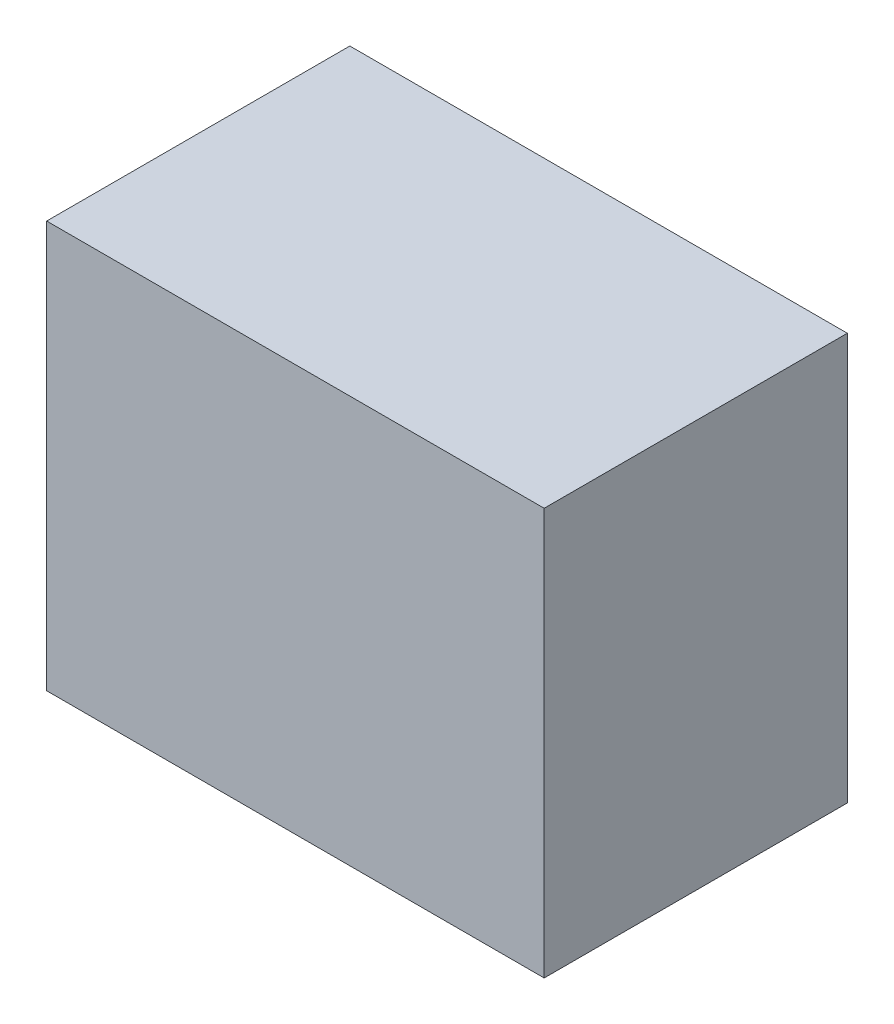
ISO-10303-21;
HEADER;
FILE_DESCRIPTION(('STEP AP214'),'2;1');
FILE_NAME('part.step','',(''),(''),'','','');
FILE_SCHEMA(('AUTOMOTIVE_DESIGN { 1 0 10303 214 1 1 1 1 }'));
ENDSEC;
DATA;
#1=APPLICATION_CONTEXT('core data for automotive mechanical design processes');
#2=APPLICATION_PROTOCOL_DEFINITION('international standard','automotive_design',2000,#1);
#3=PRODUCT_CONTEXT('',#1,'mechanical');
#4=PRODUCT('Part','Part','',(#3));
#5=PRODUCT_RELATED_PRODUCT_CATEGORY('part','',(#4));
#6=PRODUCT_DEFINITION_FORMATION('','',#4);
#7=PRODUCT_DEFINITION_CONTEXT('part definition',#1,'design');
#8=PRODUCT_DEFINITION('design','',#6,#7);
#9=PRODUCT_DEFINITION_SHAPE('','',#8);
#10=(LENGTH_UNIT() NAMED_UNIT(*) SI_UNIT(.MILLI.,.METRE.));
#11=(NAMED_UNIT(*) PLANE_ANGLE_UNIT() SI_UNIT($,.RADIAN.));
#12=(NAMED_UNIT(*) SI_UNIT($,.STERADIAN.) SOLID_ANGLE_UNIT());
#13=UNCERTAINTY_MEASURE_WITH_UNIT(LENGTH_MEASURE(1.E-05),#10,'distance_accuracy_value','');
#14=(GEOMETRIC_REPRESENTATION_CONTEXT(3) GLOBAL_UNCERTAINTY_ASSIGNED_CONTEXT((#13)) GLOBAL_UNIT_ASSIGNED_CONTEXT((#10,
#11,#12)) REPRESENTATION_CONTEXT('',''));
#15=CARTESIAN_POINT('',(0.,0.,0.));
#16=DIRECTION('',(0.,0.,1.));
#17=DIRECTION('',(1.,0.,0.));
#18=AXIS2_PLACEMENT_3D('',#15,#16,#17);
#19=CARTESIAN_POINT('',(0.96000062,0.7849997,1.1700002));
#20=DIRECTION('',(0.,0.,1.));
#21=DIRECTION('',(1.,0.,0.));
#22=AXIS2_PLACEMENT_3D('',#19,#20,#21);
#23=PLANE('',#22);
#24=DIRECTION('',(1.,0.,0.));
#25=VECTOR('',#24,1.);
#26=CARTESIAN_POINT('',(-0.96000062,0.7849997,1.1700002));
#27=LINE('',#26,#25);
#28=CARTESIAN_POINT('',(-0.96000062,0.7849997,1.1700002));
#29=VERTEX_POINT('',#28);
#30=CARTESIAN_POINT('',(0.96000062,0.7849997,1.1700002));
#31=VERTEX_POINT('',#30);
#32=EDGE_CURVE('E27',#29,#31,#27,.T.);
#33=ORIENTED_EDGE('',*,*,#32,.F.);
#34=DIRECTION('',(0.,1.,0.));
#35=VECTOR('',#34,1.);
#36=CARTESIAN_POINT('',(-0.96000062,-0.7849997,1.1700002));
#37=LINE('',#36,#35);
#38=CARTESIAN_POINT('',(-0.96000062,-0.7849997,1.1700002));
#39=VERTEX_POINT('',#38);
#40=EDGE_CURVE('E97',#39,#29,#37,.T.);
#41=ORIENTED_EDGE('',*,*,#40,.F.);
#42=DIRECTION('',(-1.,0.,0.));
#43=VECTOR('',#42,1.);
#44=CARTESIAN_POINT('',(0.96000062,-0.7849997,1.1700002));
#45=LINE('',#44,#43);
#46=CARTESIAN_POINT('',(0.96000062,-0.7849997,1.1700002));
#47=VERTEX_POINT('',#46);
#48=EDGE_CURVE('E80',#47,#39,#45,.T.);
#49=ORIENTED_EDGE('',*,*,#48,.F.);
#50=DIRECTION('',(0.,-1.,0.));
#51=VECTOR('',#50,1.);
#52=CARTESIAN_POINT('',(0.96000062,0.7849997,1.1700002));
#53=LINE('',#52,#51);
#54=EDGE_CURVE('E85',#31,#47,#53,.T.);
#55=ORIENTED_EDGE('',*,*,#54,.F.);
#56=EDGE_LOOP('',(#33,#41,#49,#55));
#57=FACE_BOUND('',#56,.T.);
#58=ADVANCED_FACE('F17',(#57),#23,.T.);
#59=CARTESIAN_POINT('',(0.96000062,0.7849997,0.));
#60=DIRECTION('',(0.,0.,1.));
#61=DIRECTION('',(1.,0.,0.));
#62=AXIS2_PLACEMENT_3D('',#59,#60,#61);
#63=PLANE('',#62);
#64=DIRECTION('',(0.,-1.,0.));
#65=VECTOR('',#64,1.);
#66=CARTESIAN_POINT('',(0.96000062,0.7849997,0.));
#67=LINE('',#66,#65);
#68=CARTESIAN_POINT('',(0.96000062,0.7849997,0.));
#69=VERTEX_POINT('',#68);
#70=CARTESIAN_POINT('',(0.96000062,-0.7849997,0.));
#71=VERTEX_POINT('',#70);
#72=EDGE_CURVE('E68',#69,#71,#67,.T.);
#73=ORIENTED_EDGE('',*,*,#72,.T.);
#74=DIRECTION('',(-1.,0.,0.));
#75=VECTOR('',#74,1.);
#76=CARTESIAN_POINT('',(0.96000062,-0.7849997,0.));
#77=LINE('',#76,#75);
#78=CARTESIAN_POINT('',(-0.96000062,-0.7849997,0.));
#79=VERTEX_POINT('',#78);
#80=EDGE_CURVE('E108',#71,#79,#77,.T.);
#81=ORIENTED_EDGE('',*,*,#80,.T.);
#82=DIRECTION('',(0.,1.,0.));
#83=VECTOR('',#82,1.);
#84=CARTESIAN_POINT('',(-0.96000062,-0.7849997,0.));
#85=LINE('',#84,#83);
#86=CARTESIAN_POINT('',(-0.96000062,0.7849997,0.));
#87=VERTEX_POINT('',#86);
#88=EDGE_CURVE('E20',#79,#87,#85,.T.);
#89=ORIENTED_EDGE('',*,*,#88,.T.);
#90=DIRECTION('',(1.,0.,0.));
#91=VECTOR('',#90,1.);
#92=CARTESIAN_POINT('',(-0.96000062,0.7849997,0.));
#93=LINE('',#92,#91);
#94=EDGE_CURVE('E11',#87,#69,#93,.T.);
#95=ORIENTED_EDGE('',*,*,#94,.T.);
#96=EDGE_LOOP('',(#73,#81,#89,#95));
#97=FACE_BOUND('',#96,.T.);
#98=ADVANCED_FACE('F66',(#97),#63,.F.);
#99=CARTESIAN_POINT('',(-0.96000062,0.7849997,0.));
#100=DIRECTION('',(0.,1.,0.));
#101=DIRECTION('',(1.,0.,0.));
#102=AXIS2_PLACEMENT_3D('',#99,#100,#101);
#103=PLANE('',#102);
#104=DIRECTION('',(0.,0.,1.));
#105=VECTOR('',#104,1.);
#106=CARTESIAN_POINT('',(-0.96000062,0.7849997,0.));
#107=LINE('',#106,#105);
#108=EDGE_CURVE('E95',#87,#29,#107,.T.);
#109=ORIENTED_EDGE('',*,*,#108,.T.);
#110=ORIENTED_EDGE('',*,*,#32,.T.);
#111=DIRECTION('',(0.,0.,1.));
#112=VECTOR('',#111,1.);
#113=CARTESIAN_POINT('',(0.96000062,0.7849997,0.));
#114=LINE('',#113,#112);
#115=EDGE_CURVE('E76',#69,#31,#114,.T.);
#116=ORIENTED_EDGE('',*,*,#115,.F.);
#117=ORIENTED_EDGE('',*,*,#94,.F.);
#118=EDGE_LOOP('',(#109,#110,#116,#117));
#119=FACE_BOUND('',#118,.T.);
#120=ADVANCED_FACE('F82',(#119),#103,.T.);
#121=CARTESIAN_POINT('',(-0.96000062,-0.7849997,0.));
#122=DIRECTION('',(-1.,0.,0.));
#123=DIRECTION('',(0.,0.,1.));
#124=AXIS2_PLACEMENT_3D('',#121,#122,#123);
#125=PLANE('',#124);
#126=DIRECTION('',(0.,0.,1.));
#127=VECTOR('',#126,1.);
#128=CARTESIAN_POINT('',(-0.96000062,-0.7849997,0.));
#129=LINE('',#128,#127);
#130=EDGE_CURVE('E104',#79,#39,#129,.T.);
#131=ORIENTED_EDGE('',*,*,#130,.T.);
#132=ORIENTED_EDGE('',*,*,#40,.T.);
#133=ORIENTED_EDGE('',*,*,#108,.F.);
#134=ORIENTED_EDGE('',*,*,#88,.F.);
#135=EDGE_LOOP('',(#131,#132,#133,#134));
#136=FACE_BOUND('',#135,.T.);
#137=ADVANCED_FACE('F115',(#136),#125,.T.);
#138=CARTESIAN_POINT('',(0.96000062,-0.7849997,0.));
#139=DIRECTION('',(0.,-1.,0.));
#140=DIRECTION('',(0.,0.,-1.));
#141=AXIS2_PLACEMENT_3D('',#138,#139,#140);
#142=PLANE('',#141);
#143=DIRECTION('',(0.,0.,1.));
#144=VECTOR('',#143,1.);
#145=CARTESIAN_POINT('',(0.96000062,-0.7849997,0.));
#146=LINE('',#145,#144);
#147=EDGE_CURVE('E78',#71,#47,#146,.T.);
#148=ORIENTED_EDGE('',*,*,#147,.T.);
#149=ORIENTED_EDGE('',*,*,#48,.T.);
#150=ORIENTED_EDGE('',*,*,#130,.F.);
#151=ORIENTED_EDGE('',*,*,#80,.F.);
#152=EDGE_LOOP('',(#148,#149,#150,#151));
#153=FACE_BOUND('',#152,.T.);
#154=ADVANCED_FACE('F119',(#153),#142,.T.);
#155=CARTESIAN_POINT('',(0.96000062,0.7849997,0.));
#156=DIRECTION('',(1.,0.,0.));
#157=DIRECTION('',(0.,1.,0.));
#158=AXIS2_PLACEMENT_3D('',#155,#156,#157);
#159=PLANE('',#158);
#160=ORIENTED_EDGE('',*,*,#115,.T.);
#161=ORIENTED_EDGE('',*,*,#54,.T.);
#162=ORIENTED_EDGE('',*,*,#147,.F.);
#163=ORIENTED_EDGE('',*,*,#72,.F.);
#164=EDGE_LOOP('',(#160,#161,#162,#163));
#165=FACE_BOUND('',#164,.T.);
#166=ADVANCED_FACE('F74',(#165),#159,.T.);
#167=CLOSED_SHELL('',(#58,#98,#120,#137,#154,#166));
#168=MANIFOLD_SOLID_BREP('B1',#167);
#169=ADVANCED_BREP_SHAPE_REPRESENTATION('',(#18,#168),#14);
#170=SHAPE_DEFINITION_REPRESENTATION(#9,#169);
ENDSEC;
END-ISO-10303-21;
